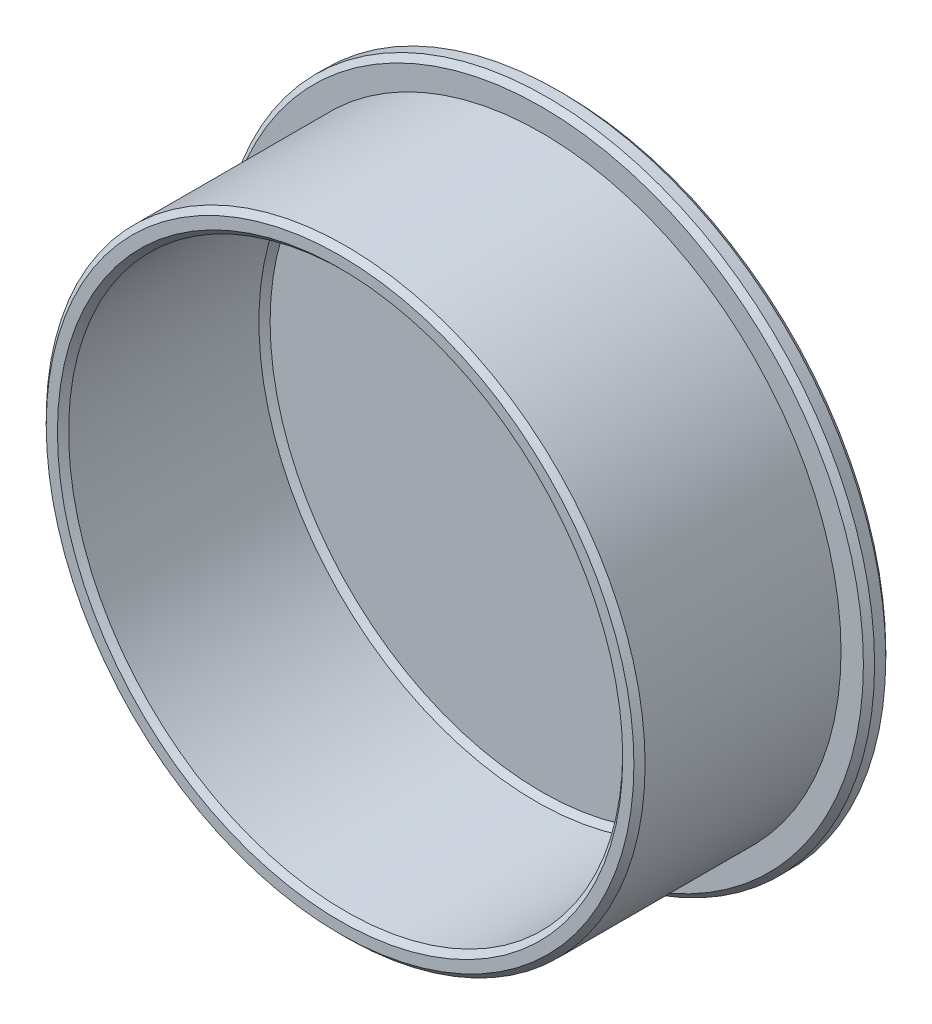
ISO-10303-21;
HEADER;
FILE_DESCRIPTION(('STEP AP214'),'2;1');
FILE_NAME('part.step','',(''),(''),'','','');
FILE_SCHEMA(('AUTOMOTIVE_DESIGN { 1 0 10303 214 1 1 1 1 }'));
ENDSEC;
DATA;
#1=APPLICATION_CONTEXT('core data for automotive mechanical design processes');
#2=APPLICATION_PROTOCOL_DEFINITION('international standard','automotive_design',2000,#1);
#3=PRODUCT_CONTEXT('',#1,'mechanical');
#4=PRODUCT('Part','Part','',(#3));
#5=PRODUCT_RELATED_PRODUCT_CATEGORY('part','',(#4));
#6=PRODUCT_DEFINITION_FORMATION('','',#4);
#7=PRODUCT_DEFINITION_CONTEXT('part definition',#1,'design');
#8=PRODUCT_DEFINITION('design','',#6,#7);
#9=PRODUCT_DEFINITION_SHAPE('','',#8);
#10=(LENGTH_UNIT() NAMED_UNIT(*) SI_UNIT(.MILLI.,.METRE.));
#11=(NAMED_UNIT(*) PLANE_ANGLE_UNIT() SI_UNIT($,.RADIAN.));
#12=(NAMED_UNIT(*) SI_UNIT($,.STERADIAN.) SOLID_ANGLE_UNIT());
#13=UNCERTAINTY_MEASURE_WITH_UNIT(LENGTH_MEASURE(1.E-05),#10,'distance_accuracy_value','');
#14=(GEOMETRIC_REPRESENTATION_CONTEXT(3) GLOBAL_UNCERTAINTY_ASSIGNED_CONTEXT((#13)) GLOBAL_UNIT_ASSIGNED_CONTEXT((#10,
#11,#12)) REPRESENTATION_CONTEXT('',''));
#15=CARTESIAN_POINT('',(0.,0.,0.));
#16=DIRECTION('',(0.,0.,1.));
#17=DIRECTION('',(1.,0.,0.));
#18=AXIS2_PLACEMENT_3D('',#15,#16,#17);
#19=CARTESIAN_POINT('',(0.,0.,2.));
#20=DIRECTION('',(0.,0.,-1.));
#21=DIRECTION('',(-1.,0.,0.));
#22=AXIS2_PLACEMENT_3D('',#19,#20,#21);
#23=CYLINDRICAL_SURFACE('',#22,29.25);
#24=CARTESIAN_POINT('',(0.,0.,0.500000000000007));
#25=DIRECTION('',(0.,0.,1.));
#26=DIRECTION('',(1.,0.,0.));
#27=AXIS2_PLACEMENT_3D('',#24,#25,#26);
#28=CIRCLE('',#27,29.25);
#29=CARTESIAN_POINT('',(29.25,0.,0.500000000000007));
#30=VERTEX_POINT('',#29);
#31=EDGE_CURVE('E75',#30,#30,#28,.T.);
#32=ORIENTED_EDGE('',*,*,#31,.T.);
#33=EDGE_LOOP('',(#32));
#34=FACE_BOUND('',#33,.T.);
#35=CARTESIAN_POINT('',(0.,0.,1.50000000000002));
#36=DIRECTION('',(0.,0.,1.));
#37=DIRECTION('',(1.,0.,0.));
#38=AXIS2_PLACEMENT_3D('',#35,#36,#37);
#39=CIRCLE('',#38,29.25);
#40=CARTESIAN_POINT('',(29.25,0.,1.50000000000002));
#41=VERTEX_POINT('',#40);
#42=EDGE_CURVE('E78',#41,#41,#39,.F.);
#43=ORIENTED_EDGE('',*,*,#42,.T.);
#44=EDGE_LOOP('',(#43));
#45=FACE_BOUND('',#44,.T.);
#46=ADVANCED_FACE('F42',(#34,#45),#23,.T.);
#47=CARTESIAN_POINT('',(0.,0.,2.));
#48=DIRECTION('',(0.,0.,1.));
#49=DIRECTION('',(1.,0.,0.));
#50=AXIS2_PLACEMENT_3D('',#47,#48,#49);
#51=PLANE('',#50);
#52=CARTESIAN_POINT('',(0.,0.,2.));
#53=DIRECTION('',(0.,0.,1.));
#54=DIRECTION('',(1.,0.,0.));
#55=AXIS2_PLACEMENT_3D('',#52,#53,#54);
#56=CIRCLE('',#55,28.75);
#57=CARTESIAN_POINT('',(28.75,0.,2.));
#58=VERTEX_POINT('',#57);
#59=EDGE_CURVE('E11',#58,#58,#56,.T.);
#60=ORIENTED_EDGE('',*,*,#59,.T.);
#61=EDGE_LOOP('',(#60));
#62=FACE_BOUND('',#61,.T.);
#63=CARTESIAN_POINT('',(0.,0.,2.));
#64=DIRECTION('',(0.,0.,1.));
#65=DIRECTION('',(1.,0.,0.));
#66=AXIS2_PLACEMENT_3D('',#63,#64,#65);
#67=CIRCLE('',#66,26.75);
#68=CARTESIAN_POINT('',(26.75,0.,2.));
#69=VERTEX_POINT('',#68);
#70=EDGE_CURVE('E81',#69,#69,#67,.F.);
#71=ORIENTED_EDGE('',*,*,#70,.T.);
#72=EDGE_LOOP('',(#71));
#73=FACE_BOUND('',#72,.T.);
#74=ADVANCED_FACE('F85',(#62,#73),#51,.T.);
#75=CARTESIAN_POINT('',(0.,0.,0.));
#76=DIRECTION('',(0.,0.,1.));
#77=DIRECTION('',(1.,0.,0.));
#78=AXIS2_PLACEMENT_3D('',#75,#76,#77);
#79=PLANE('',#78);
#80=CARTESIAN_POINT('',(0.,0.,0.));
#81=DIRECTION('',(0.,0.,1.));
#82=DIRECTION('',(1.,0.,0.));
#83=AXIS2_PLACEMENT_3D('',#80,#81,#82);
#84=CIRCLE('',#83,28.75);
#85=CARTESIAN_POINT('',(28.75,0.,0.));
#86=VERTEX_POINT('',#85);
#87=EDGE_CURVE('E72',#86,#86,#84,.F.);
#88=ORIENTED_EDGE('',*,*,#87,.T.);
#89=EDGE_LOOP('',(#88));
#90=FACE_BOUND('',#89,.T.);
#91=ADVANCED_FACE('F100',(#90),#79,.F.);
#92=CARTESIAN_POINT('',(0.,0.,113.660425586961));
#93=DIRECTION('',(0.,0.,-1.));
#94=DIRECTION('',(-1.,0.,0.));
#95=AXIS2_PLACEMENT_3D('',#92,#93,#94);
#96=CYLINDRICAL_SURFACE('',#95,24.75);
#97=CARTESIAN_POINT('',(0.,0.,19.5));
#98=DIRECTION('',(0.,0.,1.));
#99=DIRECTION('',(1.,0.,0.));
#100=AXIS2_PLACEMENT_3D('',#97,#98,#99);
#101=CIRCLE('',#100,24.75);
#102=CARTESIAN_POINT('',(24.75,0.,19.5));
#103=VERTEX_POINT('',#102);
#104=EDGE_CURVE('E54',#103,#103,#101,.T.);
#105=ORIENTED_EDGE('',*,*,#104,.T.);
#106=EDGE_LOOP('',(#105));
#107=FACE_BOUND('',#106,.T.);
#108=CARTESIAN_POINT('',(0.,0.,2.50000000000004));
#109=DIRECTION('',(0.,0.,1.));
#110=DIRECTION('',(1.,0.,0.));
#111=AXIS2_PLACEMENT_3D('',#108,#109,#110);
#112=CIRCLE('',#111,24.75);
#113=CARTESIAN_POINT('',(24.75,0.,2.50000000000004));
#114=VERTEX_POINT('',#113);
#115=EDGE_CURVE('E58',#114,#114,#112,.F.);
#116=ORIENTED_EDGE('',*,*,#115,.T.);
#117=EDGE_LOOP('',(#116));
#118=FACE_BOUND('',#117,.T.);
#119=ADVANCED_FACE('F90',(#107,#118),#96,.F.);
#120=CARTESIAN_POINT('',(0.,0.,113.660425586961));
#121=DIRECTION('',(0.,0.,-1.));
#122=DIRECTION('',(-1.,0.,0.));
#123=AXIS2_PLACEMENT_3D('',#120,#121,#122);
#124=CYLINDRICAL_SURFACE('',#123,26.75);
#125=CARTESIAN_POINT('',(0.,0.,19.5000000000001));
#126=DIRECTION('',(0.,0.,1.));
#127=DIRECTION('',(1.,0.,0.));
#128=AXIS2_PLACEMENT_3D('',#125,#126,#127);
#129=CIRCLE('',#128,26.75);
#130=CARTESIAN_POINT('',(26.75,0.,19.5000000000001));
#131=VERTEX_POINT('',#130);
#132=EDGE_CURVE('E63',#131,#131,#129,.F.);
#133=ORIENTED_EDGE('',*,*,#132,.T.);
#134=EDGE_LOOP('',(#133));
#135=FACE_BOUND('',#134,.T.);
#136=ORIENTED_EDGE('',*,*,#70,.F.);
#137=EDGE_LOOP('',(#136));
#138=FACE_BOUND('',#137,.T.);
#139=ADVANCED_FACE('F87',(#135,#138),#124,.T.);
#140=CARTESIAN_POINT('',(0.,0.,20.));
#141=DIRECTION('',(0.,0.,1.));
#142=DIRECTION('',(1.,0.,0.));
#143=AXIS2_PLACEMENT_3D('',#140,#141,#142);
#144=PLANE('',#143);
#145=CARTESIAN_POINT('',(0.,0.,20.));
#146=DIRECTION('',(0.,0.,1.));
#147=DIRECTION('',(1.,0.,0.));
#148=AXIS2_PLACEMENT_3D('',#145,#146,#147);
#149=CIRCLE('',#148,26.2500000000001);
#150=CARTESIAN_POINT('',(26.2500000000001,0.,20.));
#151=VERTEX_POINT('',#150);
#152=EDGE_CURVE('E66',#151,#151,#149,.T.);
#153=ORIENTED_EDGE('',*,*,#152,.T.);
#154=EDGE_LOOP('',(#153));
#155=FACE_BOUND('',#154,.T.);
#156=CARTESIAN_POINT('',(0.,0.,20.));
#157=DIRECTION('',(0.,0.,1.));
#158=DIRECTION('',(1.,0.,0.));
#159=AXIS2_PLACEMENT_3D('',#156,#157,#158);
#160=CIRCLE('',#159,25.25);
#161=CARTESIAN_POINT('',(25.25,0.,20.));
#162=VERTEX_POINT('',#161);
#163=EDGE_CURVE('E69',#162,#162,#160,.F.);
#164=ORIENTED_EDGE('',*,*,#163,.T.);
#165=EDGE_LOOP('',(#164));
#166=FACE_BOUND('',#165,.T.);
#167=ADVANCED_FACE('F89',(#155,#166),#144,.T.);
#168=CARTESIAN_POINT('',(0.,0.,2.));
#169=DIRECTION('',(0.,0.,1.));
#170=DIRECTION('',(1.,0.,0.));
#171=AXIS2_PLACEMENT_3D('',#168,#169,#170);
#172=CIRCLE('',#171,24.25);
#173=CARTESIAN_POINT('',(24.25,0.,2.));
#174=VERTEX_POINT('',#173);
#175=EDGE_CURVE('E50',#174,#174,#172,.T.);
#176=ORIENTED_EDGE('',*,*,#175,.T.);
#177=EDGE_LOOP('',(#176));
#178=FACE_BOUND('',#177,.T.);
#179=ADVANCED_FACE('F97',(#178),#51,.T.);
#180=CARTESIAN_POINT('',(0.,0.,0.500000000000007));
#181=DIRECTION('',(0.,0.,1.));
#182=DIRECTION('',(1.,0.,0.));
#183=AXIS2_PLACEMENT_3D('',#180,#181,#182);
#184=CONICAL_SURFACE('',#183,29.25,0.785398163397445);
#185=ORIENTED_EDGE('',*,*,#87,.F.);
#186=EDGE_LOOP('',(#185));
#187=FACE_BOUND('',#186,.T.);
#188=ORIENTED_EDGE('',*,*,#31,.F.);
#189=EDGE_LOOP('',(#188));
#190=FACE_BOUND('',#189,.T.);
#191=ADVANCED_FACE('F114',(#187,#190),#184,.T.);
#192=CARTESIAN_POINT('',(0.,0.,20.));
#193=DIRECTION('',(0.,0.,-1.));
#194=DIRECTION('',(-1.,0.,0.));
#195=AXIS2_PLACEMENT_3D('',#192,#193,#194);
#196=CONICAL_SURFACE('',#195,26.2500000000001,0.785398163397428);
#197=ORIENTED_EDGE('',*,*,#132,.F.);
#198=EDGE_LOOP('',(#197));
#199=FACE_BOUND('',#198,.T.);
#200=ORIENTED_EDGE('',*,*,#152,.F.);
#201=EDGE_LOOP('',(#200));
#202=FACE_BOUND('',#201,.T.);
#203=ADVANCED_FACE('F120',(#199,#202),#196,.T.);
#204=CARTESIAN_POINT('',(0.,0.,19.5));
#205=DIRECTION('',(0.,0.,1.));
#206=DIRECTION('',(1.,0.,0.));
#207=AXIS2_PLACEMENT_3D('',#204,#205,#206);
#208=CONICAL_SURFACE('',#207,24.75,0.785398163397441);
#209=ORIENTED_EDGE('',*,*,#163,.F.);
#210=EDGE_LOOP('',(#209));
#211=FACE_BOUND('',#210,.T.);
#212=ORIENTED_EDGE('',*,*,#104,.F.);
#213=EDGE_LOOP('',(#212));
#214=FACE_BOUND('',#213,.T.);
#215=ADVANCED_FACE('F127',(#211,#214),#208,.F.);
#216=CARTESIAN_POINT('',(0.,0.,2.50000000000004));
#217=DIRECTION('',(0.,0.,1.));
#218=DIRECTION('',(1.,0.,0.));
#219=AXIS2_PLACEMENT_3D('',#216,#217,#218);
#220=CONICAL_SURFACE('',#219,24.75,0.785398163397448);
#221=ORIENTED_EDGE('',*,*,#175,.F.);
#222=EDGE_LOOP('',(#221));
#223=FACE_BOUND('',#222,.T.);
#224=ORIENTED_EDGE('',*,*,#115,.F.);
#225=EDGE_LOOP('',(#224));
#226=FACE_BOUND('',#225,.T.);
#227=ADVANCED_FACE('F133',(#223,#226),#220,.F.);
#228=CARTESIAN_POINT('',(0.,0.,2.));
#229=DIRECTION('',(0.,0.,-1.));
#230=DIRECTION('',(-1.,0.,0.));
#231=AXIS2_PLACEMENT_3D('',#228,#229,#230);
#232=CONICAL_SURFACE('',#231,28.75,0.785398163397445);
#233=ORIENTED_EDGE('',*,*,#42,.F.);
#234=EDGE_LOOP('',(#233));
#235=FACE_BOUND('',#234,.T.);
#236=ORIENTED_EDGE('',*,*,#59,.F.);
#237=EDGE_LOOP('',(#236));
#238=FACE_BOUND('',#237,.T.);
#239=ADVANCED_FACE('F45',(#235,#238),#232,.T.);
#240=CLOSED_SHELL('',(#46,#74,#91,#119,#139,#167,#179,#191,#203,#215,#227,#239));
#241=MANIFOLD_SOLID_BREP('B2',#240);
#242=ADVANCED_BREP_SHAPE_REPRESENTATION('',(#18,#241),#14);
#243=SHAPE_DEFINITION_REPRESENTATION(#9,#242);
ENDSEC;
END-ISO-10303-21;
